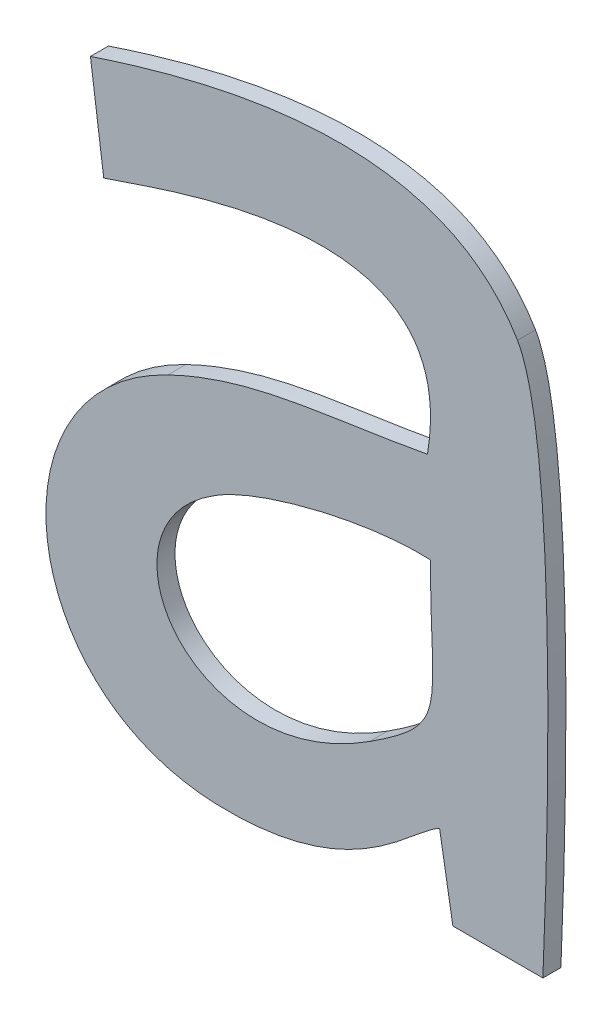
ISO-10303-21;
HEADER;
FILE_DESCRIPTION(('STEP AP214'),'2;1');
FILE_NAME('part.step','',(''),(''),'','','');
FILE_SCHEMA(('AUTOMOTIVE_DESIGN { 1 0 10303 214 1 1 1 1 }'));
ENDSEC;
DATA;
#1=APPLICATION_CONTEXT('core data for automotive mechanical design processes');
#2=APPLICATION_PROTOCOL_DEFINITION('international standard','automotive_design',2000,#1);
#3=PRODUCT_CONTEXT('',#1,'mechanical');
#4=PRODUCT('Part','Part','',(#3));
#5=PRODUCT_RELATED_PRODUCT_CATEGORY('part','',(#4));
#6=PRODUCT_DEFINITION_FORMATION('','',#4);
#7=PRODUCT_DEFINITION_CONTEXT('part definition',#1,'design');
#8=PRODUCT_DEFINITION('design','',#6,#7);
#9=PRODUCT_DEFINITION_SHAPE('','',#8);
#10=(LENGTH_UNIT() NAMED_UNIT(*) SI_UNIT(.MILLI.,.METRE.));
#11=(NAMED_UNIT(*) PLANE_ANGLE_UNIT() SI_UNIT($,.RADIAN.));
#12=(NAMED_UNIT(*) SI_UNIT($,.STERADIAN.) SOLID_ANGLE_UNIT());
#13=UNCERTAINTY_MEASURE_WITH_UNIT(LENGTH_MEASURE(1.E-05),#10,'distance_accuracy_value','');
#14=(GEOMETRIC_REPRESENTATION_CONTEXT(3) GLOBAL_UNCERTAINTY_ASSIGNED_CONTEXT((#13)) GLOBAL_UNIT_ASSIGNED_CONTEXT((#10,
#11,#12)) REPRESENTATION_CONTEXT('',''));
#15=CARTESIAN_POINT('',(0.,0.,0.));
#16=DIRECTION('',(0.,0.,1.));
#17=DIRECTION('',(1.,0.,0.));
#18=AXIS2_PLACEMENT_3D('',#15,#16,#17);
#19=CARTESIAN_POINT('',(-1.7916917578125,-48.6384592578125,0.001));
#20=CARTESIAN_POINT('',(-1.7916917578125,-48.6384592578125,0.));
#21=CARTESIAN_POINT('',(-1.7914358203125,-48.6326046875,0.001));
#22=CARTESIAN_POINT('',(-1.7914358203125,-48.6326046875,0.));
#23=CARTESIAN_POINT('',(-1.7907959765625,-48.6124816015625,0.001));
#24=CARTESIAN_POINT('',(-1.7907959765625,-48.6124816015625,0.));
#25=CARTESIAN_POINT('',(-1.7930994140625,-48.6085465625,0.001));
#26=CARTESIAN_POINT('',(-1.7930994140625,-48.6085465625,0.));
#27=B_SPLINE_SURFACE_WITH_KNOTS('',3,1,((#19,#20),(#21,#22),(#23,#24),(#25,#26)),.UNSPECIFIED.,
.F.,.F.,.F.,(4,4),(2,2),(0.6,0.7),(0.,1.),.UNSPECIFIED.);
#28=CARTESIAN_POINT('',(-1.7916917578125,-48.6384592578125,0.));
#29=CARTESIAN_POINT('',(-1.7914358203125,-48.6326046875,0.));
#30=CARTESIAN_POINT('',(-1.7907959765625,-48.6124816015625,0.));
#31=CARTESIAN_POINT('',(-1.7930994140625,-48.6085465625,0.));
#32=B_SPLINE_CURVE_WITH_KNOTS('',3,(#28,#29,#30,#31),.UNSPECIFIED.,.F.,.F.,(4,4),(0.6,0.7),.UNSPECIFIED.);
#33=CARTESIAN_POINT('',(-1.7916917578125,-48.6384592578125,0.));
#34=VERTEX_POINT('',#33);
#35=CARTESIAN_POINT('',(-1.7930994140625,-48.6085465625,0.));
#36=VERTEX_POINT('',#35);
#37=EDGE_CURVE('E11',#34,#36,#32,.T.);
#38=DIRECTION('',(0.,0.,-1.));
#39=VECTOR('',#38,1.);
#40=CARTESIAN_POINT('',(-1.7930994140625,-48.6085465625,0.001));
#41=LINE('',#40,#39);
#42=CARTESIAN_POINT('',(-1.7930994140625,-48.6085465625,0.001));
#43=VERTEX_POINT('',#42);
#44=EDGE_CURVE('E28',#43,#36,#41,.T.);
#45=CARTESIAN_POINT('',(-1.7916917578125,-48.6384592578125,0.001));
#46=CARTESIAN_POINT('',(-1.7914358203125,-48.6326046875,0.001));
#47=CARTESIAN_POINT('',(-1.7907959765625,-48.6124816015625,0.001));
#48=CARTESIAN_POINT('',(-1.7930994140625,-48.6085465625,0.001));
#49=B_SPLINE_CURVE_WITH_KNOTS('',3,(#45,#46,#47,#48),.UNSPECIFIED.,.F.,.F.,(4,4),(0.6,0.7),.UNSPECIFIED.);
#50=CARTESIAN_POINT('',(-1.7916917578125,-48.6384592578125,0.001));
#51=VERTEX_POINT('',#50);
#52=EDGE_CURVE('E279',#51,#43,#49,.T.);
#53=DIRECTION('',(0.,0.,-1.));
#54=VECTOR('',#53,1.);
#55=CARTESIAN_POINT('',(-1.7916917578125,-48.6384592578125,0.001));
#56=LINE('',#55,#54);
#57=EDGE_CURVE('E40',#51,#34,#56,.T.);
#58=ORIENTED_EDGE('',*,*,#37,.T.);
#59=ORIENTED_EDGE('',*,*,#44,.F.);
#60=ORIENTED_EDGE('',*,*,#52,.F.);
#61=ORIENTED_EDGE('',*,*,#57,.T.);
#62=EDGE_LOOP('',(#58,#59,#60,#61));
#63=FACE_BOUND('',#62,.T.);
#64=ADVANCED_FACE('F17',(#63),#27,.F.);
#65=CARTESIAN_POINT('',(-1.7930994140625,-48.6085465625,0.001));
#66=CARTESIAN_POINT('',(-1.7930994140625,-48.6085465625,0.));
#67=CARTESIAN_POINT('',(-1.7973863671875,-48.6012843359375,0.001));
#68=CARTESIAN_POINT('',(-1.7973863671875,-48.6012843359375,0.));
#69=CARTESIAN_POINT('',(-1.8093514453125,-48.6042916015625,0.001));
#70=CARTESIAN_POINT('',(-1.8093514453125,-48.6042916015625,0.));
#71=CARTESIAN_POINT('',(-1.8167736328125,-48.606755,0.001));
#72=CARTESIAN_POINT('',(-1.8167736328125,-48.606755,0.));
#73=B_SPLINE_SURFACE_WITH_KNOTS('',3,1,((#65,#66),(#67,#68),(#69,#70),(#71,#72)),.UNSPECIFIED.,
.F.,.F.,.F.,(4,4),(2,2),(0.7,0.8),(0.,1.),.UNSPECIFIED.);
#74=CARTESIAN_POINT('',(-1.7930994140625,-48.6085465625,0.));
#75=CARTESIAN_POINT('',(-1.7973863671875,-48.6012843359375,0.));
#76=CARTESIAN_POINT('',(-1.8093514453125,-48.6042916015625,0.));
#77=CARTESIAN_POINT('',(-1.8167736328125,-48.606755,0.));
#78=B_SPLINE_CURVE_WITH_KNOTS('',3,(#74,#75,#76,#77),.UNSPECIFIED.,.F.,.F.,(4,4),(0.7,0.8),.UNSPECIFIED.);
#79=CARTESIAN_POINT('',(-1.8167736328125,-48.606755,0.));
#80=VERTEX_POINT('',#79);
#81=EDGE_CURVE('E271',#36,#80,#78,.T.);
#82=DIRECTION('',(0.,0.,-1.));
#83=VECTOR('',#82,1.);
#84=CARTESIAN_POINT('',(-1.8167736328125,-48.606755,0.001));
#85=LINE('',#84,#83);
#86=CARTESIAN_POINT('',(-1.8167736328125,-48.606755,0.001));
#87=VERTEX_POINT('',#86);
#88=EDGE_CURVE('E266',#87,#80,#85,.T.);
#89=CARTESIAN_POINT('',(-1.7930994140625,-48.6085465625,0.001));
#90=CARTESIAN_POINT('',(-1.7973863671875,-48.6012843359375,0.001));
#91=CARTESIAN_POINT('',(-1.8093514453125,-48.6042916015625,0.001));
#92=CARTESIAN_POINT('',(-1.8167736328125,-48.606755,0.001));
#93=B_SPLINE_CURVE_WITH_KNOTS('',3,(#89,#90,#91,#92),.UNSPECIFIED.,.F.,.F.,(4,4),(0.7,0.8),.UNSPECIFIED.);
#94=EDGE_CURVE('E262',#43,#87,#93,.T.);
#95=ORIENTED_EDGE('',*,*,#81,.T.);
#96=ORIENTED_EDGE('',*,*,#88,.F.);
#97=ORIENTED_EDGE('',*,*,#94,.F.);
#98=ORIENTED_EDGE('',*,*,#44,.T.);
#99=EDGE_LOOP('',(#95,#96,#97,#98));
#100=FACE_BOUND('',#99,.T.);
#101=ADVANCED_FACE('F289',(#100),#73,.F.);
#102=CARTESIAN_POINT('',(-8.2060680286312,-1.1037401442036,0.001));
#103=DIRECTION('',(0.99107539235019,0.133302538152571,0.));
#104=DIRECTION('',(-0.133302538152571,0.99107539235019,0.));
#105=AXIS2_PLACEMENT_3D('',#102,#103,#104);
#106=PLANE('',#105);
#107=DIRECTION('',(0.133302538152571,-0.99107539235019,0.));
#108=VECTOR('',#107,1.);
#109=CARTESIAN_POINT('',(-8.2060680286312,-1.1037401442036,0.));
#110=LINE('',#109,#108);
#111=CARTESIAN_POINT('',(-1.8160378125,-48.6122256640625,0.));
#112=VERTEX_POINT('',#111);
#113=EDGE_CURVE('E260',#80,#112,#110,.T.);
#114=ORIENTED_EDGE('',*,*,#113,.T.);
#115=DIRECTION('',(0.,0.,-1.));
#116=VECTOR('',#115,1.);
#117=CARTESIAN_POINT('',(-1.8160378125,-48.6122256640625,0.001));
#118=LINE('',#117,#116);
#119=CARTESIAN_POINT('',(-1.8160378125,-48.6122256640625,0.001));
#120=VERTEX_POINT('',#119);
#121=EDGE_CURVE('E257',#120,#112,#118,.T.);
#122=ORIENTED_EDGE('',*,*,#121,.F.);
#123=DIRECTION('',(0.133302538152571,-0.99107539235019,0.));
#124=VECTOR('',#123,1.);
#125=CARTESIAN_POINT('',(-8.2060680286312,-1.1037401442036,0.001));
#126=LINE('',#125,#124);
#127=EDGE_CURVE('E251',#87,#120,#126,.T.);
#128=ORIENTED_EDGE('',*,*,#127,.F.);
#129=ORIENTED_EDGE('',*,*,#88,.T.);
#130=EDGE_LOOP('',(#114,#122,#128,#129));
#131=FACE_BOUND('',#130,.T.);
#132=ADVANCED_FACE('F293',(#131),#106,.F.);
#133=CARTESIAN_POINT('',(-1.8160378125,-48.6122256640625,0.001));
#134=CARTESIAN_POINT('',(-1.8160378125,-48.6122256640625,0.));
#135=CARTESIAN_POINT('',(-1.81283859375,-48.61123390625,0.001));
#136=CARTESIAN_POINT('',(-1.81283859375,-48.61123390625,0.));
#137=CARTESIAN_POINT('',(-1.7960746875,-48.6044515625,0.001));
#138=CARTESIAN_POINT('',(-1.7960746875,-48.6044515625,0.));
#139=CARTESIAN_POINT('',(-1.7980901953125,-48.6165126171875,0.001));
#140=CARTESIAN_POINT('',(-1.7980901953125,-48.6165126171875,0.));
#141=B_SPLINE_SURFACE_WITH_KNOTS('',3,1,((#133,#134),(#135,#136),(#137,#138),(#139,#140)),
.UNSPECIFIED.,.F.,.F.,.F.,(4,4),(2,2),(0.,0.1),(0.,1.),.UNSPECIFIED.);
#142=CARTESIAN_POINT('',(-1.8160378125,-48.6122256640625,0.));
#143=CARTESIAN_POINT('',(-1.81283859375,-48.61123390625,0.));
#144=CARTESIAN_POINT('',(-1.7960746875,-48.6044515625,0.));
#145=CARTESIAN_POINT('',(-1.7980901953125,-48.6165126171875,0.));
#146=B_SPLINE_CURVE_WITH_KNOTS('',3,(#142,#143,#144,#145),.UNSPECIFIED.,.F.,.F.,(4,4),(0.,0.1),.UNSPECIFIED.);
#147=CARTESIAN_POINT('',(-1.7980901953125,-48.6165126171875,0.));
#148=VERTEX_POINT('',#147);
#149=EDGE_CURVE('E246',#112,#148,#146,.T.);
#150=DIRECTION('',(0.,0.,-1.));
#151=VECTOR('',#150,1.);
#152=CARTESIAN_POINT('',(-1.7980901953125,-48.6165126171875,0.001));
#153=LINE('',#152,#151);
#154=CARTESIAN_POINT('',(-1.7980901953125,-48.6165126171875,0.001));
#155=VERTEX_POINT('',#154);
#156=EDGE_CURVE('E241',#155,#148,#153,.T.);
#157=CARTESIAN_POINT('',(-1.8160378125,-48.6122256640625,0.001));
#158=CARTESIAN_POINT('',(-1.81283859375,-48.61123390625,0.001));
#159=CARTESIAN_POINT('',(-1.7960746875,-48.6044515625,0.001));
#160=CARTESIAN_POINT('',(-1.7980901953125,-48.6165126171875,0.001));
#161=B_SPLINE_CURVE_WITH_KNOTS('',3,(#157,#158,#159,#160),.UNSPECIFIED.,.F.,.F.,(4,4),(0.,0.1),.UNSPECIFIED.);
#162=EDGE_CURVE('E234',#120,#155,#161,.T.);
#163=ORIENTED_EDGE('',*,*,#149,.T.);
#164=ORIENTED_EDGE('',*,*,#156,.F.);
#165=ORIENTED_EDGE('',*,*,#162,.F.);
#166=ORIENTED_EDGE('',*,*,#121,.T.);
#167=EDGE_LOOP('',(#163,#164,#165,#166));
#168=FACE_BOUND('',#167,.T.);
#169=ADVANCED_FACE('F297',(#168),#141,.F.);
#170=CARTESIAN_POINT('',(-1.7980901953125,-48.6165126171875,0.001));
#171=CARTESIAN_POINT('',(-1.7980901953125,-48.6165126171875,0.));
#172=CARTESIAN_POINT('',(-1.803496875,-48.6175363671875,0.001));
#173=CARTESIAN_POINT('',(-1.803496875,-48.6175363671875,0.));
#174=CARTESIAN_POINT('',(-1.8077518359375,-48.6176003515625,0.001));
#175=CARTESIAN_POINT('',(-1.8077518359375,-48.6176003515625,0.));
#176=CARTESIAN_POINT('',(-1.8124866796875,-48.6199037890625,0.001));
#177=CARTESIAN_POINT('',(-1.8124866796875,-48.6199037890625,0.));
#178=B_SPLINE_SURFACE_WITH_KNOTS('',3,1,((#170,#171),(#172,#173),(#174,#175),(#176,#177)),
.UNSPECIFIED.,.F.,.F.,.F.,(4,4),(2,2),(0.1,0.2),(0.,1.),.UNSPECIFIED.);
#179=CARTESIAN_POINT('',(-1.7980901953125,-48.6165126171875,0.));
#180=CARTESIAN_POINT('',(-1.803496875,-48.6175363671875,0.));
#181=CARTESIAN_POINT('',(-1.8077518359375,-48.6176003515625,0.));
#182=CARTESIAN_POINT('',(-1.8124866796875,-48.6199037890625,0.));
#183=B_SPLINE_CURVE_WITH_KNOTS('',3,(#179,#180,#181,#182),.UNSPECIFIED.,.F.,.F.,(4,4),(0.1,0.2),.UNSPECIFIED.);
#184=CARTESIAN_POINT('',(-1.8124866796875,-48.6199037890625,0.));
#185=VERTEX_POINT('',#184);
#186=EDGE_CURVE('E229',#148,#185,#183,.T.);
#187=DIRECTION('',(0.,0.,-1.));
#188=VECTOR('',#187,1.);
#189=CARTESIAN_POINT('',(-1.8124866796875,-48.6199037890625,0.001));
#190=LINE('',#189,#188);
#191=CARTESIAN_POINT('',(-1.8124866796875,-48.6199037890625,0.001));
#192=VERTEX_POINT('',#191);
#193=EDGE_CURVE('E224',#192,#185,#190,.T.);
#194=CARTESIAN_POINT('',(-1.7980901953125,-48.6165126171875,0.001));
#195=CARTESIAN_POINT('',(-1.803496875,-48.6175363671875,0.001));
#196=CARTESIAN_POINT('',(-1.8077518359375,-48.6176003515625,0.001));
#197=CARTESIAN_POINT('',(-1.8124866796875,-48.6199037890625,0.001));
#198=B_SPLINE_CURVE_WITH_KNOTS('',3,(#194,#195,#196,#197),.UNSPECIFIED.,.F.,.F.,(4,4),(0.1,0.2),.UNSPECIFIED.);
#199=EDGE_CURVE('E217',#155,#192,#198,.T.);
#200=ORIENTED_EDGE('',*,*,#186,.T.);
#201=ORIENTED_EDGE('',*,*,#193,.F.);
#202=ORIENTED_EDGE('',*,*,#199,.F.);
#203=ORIENTED_EDGE('',*,*,#156,.T.);
#204=EDGE_LOOP('',(#200,#201,#202,#203));
#205=FACE_BOUND('',#204,.T.);
#206=ADVANCED_FACE('F303',(#205),#178,.F.);
#207=CARTESIAN_POINT('',(-1.8124866796875,-48.6199037890625,0.001));
#208=CARTESIAN_POINT('',(-1.8124866796875,-48.6199037890625,0.));
#209=CARTESIAN_POINT('',(-1.8226921875,-48.62479859375,0.001));
#210=CARTESIAN_POINT('',(-1.8226921875,-48.62479859375,0.));
#211=CARTESIAN_POINT('',(-1.820964609375,-48.6387471875,0.001));
#212=CARTESIAN_POINT('',(-1.820964609375,-48.6387471875,0.));
#213=CARTESIAN_POINT('',(-1.8097993359375,-48.6391630859375,0.001));
#214=CARTESIAN_POINT('',(-1.8097993359375,-48.6391630859375,0.));
#215=B_SPLINE_SURFACE_WITH_KNOTS('',3,1,((#207,#208),(#209,#210),(#211,#212),(#213,#214)),
.UNSPECIFIED.,.F.,.F.,.F.,(4,4),(2,2),(0.2,0.3),(0.,1.),.UNSPECIFIED.);
#216=CARTESIAN_POINT('',(-1.8124866796875,-48.6199037890625,0.));
#217=CARTESIAN_POINT('',(-1.8226921875,-48.62479859375,0.));
#218=CARTESIAN_POINT('',(-1.820964609375,-48.6387471875,0.));
#219=CARTESIAN_POINT('',(-1.8097993359375,-48.6391630859375,0.));
#220=B_SPLINE_CURVE_WITH_KNOTS('',3,(#216,#217,#218,#219),.UNSPECIFIED.,.F.,.F.,(4,4),(0.2,0.3),.UNSPECIFIED.);
#221=CARTESIAN_POINT('',(-1.8097993359375,-48.6391630859375,0.));
#222=VERTEX_POINT('',#221);
#223=EDGE_CURVE('E212',#185,#222,#220,.T.);
#224=DIRECTION('',(0.,0.,-1.));
#225=VECTOR('',#224,1.);
#226=CARTESIAN_POINT('',(-1.8097993359375,-48.6391630859375,0.001));
#227=LINE('',#226,#225);
#228=CARTESIAN_POINT('',(-1.8097993359375,-48.6391630859375,0.001));
#229=VERTEX_POINT('',#228);
#230=EDGE_CURVE('E207',#229,#222,#227,.T.);
#231=CARTESIAN_POINT('',(-1.8124866796875,-48.6199037890625,0.001));
#232=CARTESIAN_POINT('',(-1.8226921875,-48.62479859375,0.001));
#233=CARTESIAN_POINT('',(-1.820964609375,-48.6387471875,0.001));
#234=CARTESIAN_POINT('',(-1.8097993359375,-48.6391630859375,0.001));
#235=B_SPLINE_CURVE_WITH_KNOTS('',3,(#231,#232,#233,#234),.UNSPECIFIED.,.F.,.F.,(4,4),(0.2,0.3),.UNSPECIFIED.);
#236=EDGE_CURVE('E200',#192,#229,#235,.T.);
#237=ORIENTED_EDGE('',*,*,#223,.T.);
#238=ORIENTED_EDGE('',*,*,#230,.F.);
#239=ORIENTED_EDGE('',*,*,#236,.F.);
#240=ORIENTED_EDGE('',*,*,#193,.T.);
#241=EDGE_LOOP('',(#237,#238,#239,#240));
#242=FACE_BOUND('',#241,.T.);
#243=ADVANCED_FACE('F309',(#242),#215,.F.);
#244=CARTESIAN_POINT('',(-1.8097993359375,-48.6391630859375,0.001));
#245=CARTESIAN_POINT('',(-1.8097993359375,-48.6391630859375,0.));
#246=CARTESIAN_POINT('',(-1.802153203125,-48.6394190234375,0.001));
#247=CARTESIAN_POINT('',(-1.802153203125,-48.6394190234375,0.));
#248=CARTESIAN_POINT('',(-1.7991139453125,-48.6350041015625,0.001));
#249=CARTESIAN_POINT('',(-1.7991139453125,-48.6350041015625,0.));
#250=CARTESIAN_POINT('',(-1.797418359375,-48.6341403125,0.001));
#251=CARTESIAN_POINT('',(-1.797418359375,-48.6341403125,0.));
#252=B_SPLINE_SURFACE_WITH_KNOTS('',3,1,((#244,#245),(#246,#247),(#248,#249),(#250,#251)),
.UNSPECIFIED.,.F.,.F.,.F.,(4,4),(2,2),(0.3,0.4),(0.,1.),.UNSPECIFIED.);
#253=CARTESIAN_POINT('',(-1.8097993359375,-48.6391630859375,0.));
#254=CARTESIAN_POINT('',(-1.802153203125,-48.6394190234375,0.));
#255=CARTESIAN_POINT('',(-1.7991139453125,-48.6350041015625,0.));
#256=CARTESIAN_POINT('',(-1.797418359375,-48.6341403125,0.));
#257=B_SPLINE_CURVE_WITH_KNOTS('',3,(#253,#254,#255,#256),.UNSPECIFIED.,.F.,.F.,(4,4),(0.3,0.4),.UNSPECIFIED.);
#258=CARTESIAN_POINT('',(-1.797418359375,-48.6341403125,0.));
#259=VERTEX_POINT('',#258);
#260=EDGE_CURVE('E195',#222,#259,#257,.T.);
#261=DIRECTION('',(0.,0.,-1.));
#262=VECTOR('',#261,1.);
#263=CARTESIAN_POINT('',(-1.797418359375,-48.6341403125,0.001));
#264=LINE('',#263,#262);
#265=CARTESIAN_POINT('',(-1.797418359375,-48.6341403125,0.001));
#266=VERTEX_POINT('',#265);
#267=EDGE_CURVE('E190',#266,#259,#264,.T.);
#268=CARTESIAN_POINT('',(-1.8097993359375,-48.6391630859375,0.001));
#269=CARTESIAN_POINT('',(-1.802153203125,-48.6394190234375,0.001));
#270=CARTESIAN_POINT('',(-1.7991139453125,-48.6350041015625,0.001));
#271=CARTESIAN_POINT('',(-1.797418359375,-48.6341403125,0.001));
#272=B_SPLINE_CURVE_WITH_KNOTS('',3,(#268,#269,#270,#271),.UNSPECIFIED.,.F.,.F.,(4,4),(0.3,0.4),.UNSPECIFIED.);
#273=EDGE_CURVE('E186',#229,#266,#272,.T.);
#274=ORIENTED_EDGE('',*,*,#260,.T.);
#275=ORIENTED_EDGE('',*,*,#267,.F.);
#276=ORIENTED_EDGE('',*,*,#273,.F.);
#277=ORIENTED_EDGE('',*,*,#230,.T.);
#278=EDGE_LOOP('',(#274,#275,#276,#277));
#279=FACE_BOUND('',#278,.T.);
#280=ADVANCED_FACE('F313',(#279),#252,.F.);
#281=CARTESIAN_POINT('',(-9.7988138674383,-1.669427547786,0.001));
#282=DIRECTION('',(0.985795457601301,0.167950337220981,0.));
#283=DIRECTION('',(-0.167950337220981,0.985795457601301,0.));
#284=AXIS2_PLACEMENT_3D('',#281,#282,#283);
#285=PLANE('',#284);
#286=DIRECTION('',(0.167950337220981,-0.985795457601301,0.));
#287=VECTOR('',#286,1.);
#288=CARTESIAN_POINT('',(-9.7988138674383,-1.669427547786,0.));
#289=LINE('',#288,#287);
#290=CARTESIAN_POINT('',(-1.7966825390625,-48.6384592578125,0.));
#291=VERTEX_POINT('',#290);
#292=EDGE_CURVE('E184',#259,#291,#289,.T.);
#293=ORIENTED_EDGE('',*,*,#292,.T.);
#294=DIRECTION('',(0.,0.,-1.));
#295=VECTOR('',#294,1.);
#296=CARTESIAN_POINT('',(-1.7966825390625,-48.6384592578125,0.001));
#297=LINE('',#296,#295);
#298=CARTESIAN_POINT('',(-1.7966825390625,-48.6384592578125,0.001));
#299=VERTEX_POINT('',#298);
#300=EDGE_CURVE('E181',#299,#291,#297,.T.);
#301=ORIENTED_EDGE('',*,*,#300,.F.);
#302=DIRECTION('',(0.167950337220981,-0.985795457601301,0.));
#303=VECTOR('',#302,1.);
#304=CARTESIAN_POINT('',(-9.7988138674383,-1.669427547786,0.001));
#305=LINE('',#304,#303);
#306=EDGE_CURVE('E175',#266,#299,#305,.T.);
#307=ORIENTED_EDGE('',*,*,#306,.F.);
#308=ORIENTED_EDGE('',*,*,#267,.T.);
#309=EDGE_LOOP('',(#293,#301,#307,#308));
#310=FACE_BOUND('',#309,.T.);
#311=ADVANCED_FACE('F317',(#310),#285,.F.);
#312=CARTESIAN_POINT('',(-1.8012894140625,-48.631900859375,0.001));
#313=CARTESIAN_POINT('',(-1.8012894140625,-48.631900859375,0.));
#314=CARTESIAN_POINT('',(-1.811366953125,-48.638427265625,0.001));
#315=CARTESIAN_POINT('',(-1.811366953125,-48.638427265625,0.));
#316=CARTESIAN_POINT('',(-1.81770140625,-48.6281577734375,0.001));
#317=CARTESIAN_POINT('',(-1.81770140625,-48.6281577734375,0.));
#318=CARTESIAN_POINT('',(-1.808935546875,-48.6238708203125,0.001));
#319=CARTESIAN_POINT('',(-1.808935546875,-48.6238708203125,0.));
#320=B_SPLINE_SURFACE_WITH_KNOTS('',3,1,((#312,#313),(#314,#315),(#316,#317),(#318,#319)),
.UNSPECIFIED.,.F.,.F.,.F.,(4,4),(2,2),(0.25,0.5),(0.,1.),.UNSPECIFIED.);
#321=CARTESIAN_POINT('',(-1.8012894140625,-48.631900859375,0.));
#322=CARTESIAN_POINT('',(-1.811366953125,-48.638427265625,0.));
#323=CARTESIAN_POINT('',(-1.81770140625,-48.6281577734375,0.));
#324=CARTESIAN_POINT('',(-1.808935546875,-48.6238708203125,0.));
#325=B_SPLINE_CURVE_WITH_KNOTS('',3,(#321,#322,#323,#324),.UNSPECIFIED.,.F.,.F.,(4,4),(0.25,
0.5),.UNSPECIFIED.);
#326=CARTESIAN_POINT('',(-1.8012894140625,-48.631900859375,0.));
#327=VERTEX_POINT('',#326);
#328=CARTESIAN_POINT('',(-1.808935546875,-48.6238708203125,0.));
#329=VERTEX_POINT('',#328);
#330=EDGE_CURVE('E170',#327,#329,#325,.T.);
#331=DIRECTION('',(0.,0.,-1.));
#332=VECTOR('',#331,1.);
#333=CARTESIAN_POINT('',(-1.808935546875,-48.6238708203125,0.001));
#334=LINE('',#333,#332);
#335=CARTESIAN_POINT('',(-1.808935546875,-48.6238708203125,0.001));
#336=VERTEX_POINT('',#335);
#337=EDGE_CURVE('E165',#336,#329,#334,.T.);
#338=CARTESIAN_POINT('',(-1.8012894140625,-48.631900859375,0.001));
#339=CARTESIAN_POINT('',(-1.811366953125,-48.638427265625,0.001));
#340=CARTESIAN_POINT('',(-1.81770140625,-48.6281577734375,0.001));
#341=CARTESIAN_POINT('',(-1.808935546875,-48.6238708203125,0.001));
#342=B_SPLINE_CURVE_WITH_KNOTS('',3,(#338,#339,#340,#341),.UNSPECIFIED.,.F.,.F.,(4,4),(0.25,
0.5),.UNSPECIFIED.);
#343=CARTESIAN_POINT('',(-1.8012894140625,-48.631900859375,0.001));
#344=VERTEX_POINT('',#343);
#345=EDGE_CURVE('E116',#344,#336,#342,.T.);
#346=DIRECTION('',(0.,0.,-1.));
#347=VECTOR('',#346,1.);
#348=CARTESIAN_POINT('',(-1.8012894140625,-48.631900859375,0.001));
#349=LINE('',#348,#347);
#350=EDGE_CURVE('E131',#344,#327,#349,.T.);
#351=ORIENTED_EDGE('',*,*,#330,.T.);
#352=ORIENTED_EDGE('',*,*,#337,.F.);
#353=ORIENTED_EDGE('',*,*,#345,.F.);
#354=ORIENTED_EDGE('',*,*,#350,.T.);
#355=EDGE_LOOP('',(#351,#352,#353,#354));
#356=FACE_BOUND('',#355,.T.);
#357=ADVANCED_FACE('F386',(#356),#320,.F.);
#358=CARTESIAN_POINT('',(-1.808935546875,-48.6238708203125,0.001));
#359=CARTESIAN_POINT('',(-1.808935546875,-48.6238708203125,0.));
#360=CARTESIAN_POINT('',(-1.8063121875,-48.6225911328125,0.001));
#361=CARTESIAN_POINT('',(-1.8063121875,-48.6225911328125,0.));
#362=CARTESIAN_POINT('',(-1.8011934375,-48.6213434375,0.001));
#363=CARTESIAN_POINT('',(-1.8011934375,-48.6213434375,0.));
#364=CARTESIAN_POINT('',(-1.797930234375,-48.6215033984375,0.001));
#365=CARTESIAN_POINT('',(-1.797930234375,-48.6215033984375,0.));
#366=B_SPLINE_SURFACE_WITH_KNOTS('',3,1,((#358,#359),(#360,#361),(#362,#363),(#364,#365)),
.UNSPECIFIED.,.F.,.F.,.F.,(4,4),(2,2),(0.5,1.),(0.,1.),.UNSPECIFIED.);
#367=CARTESIAN_POINT('',(-1.808935546875,-48.6238708203125,0.));
#368=CARTESIAN_POINT('',(-1.8063121875,-48.6225911328125,0.));
#369=CARTESIAN_POINT('',(-1.8011934375,-48.6213434375,0.));
#370=CARTESIAN_POINT('',(-1.797930234375,-48.6215033984375,0.));
#371=B_SPLINE_CURVE_WITH_KNOTS('',3,(#367,#368,#369,#370),.UNSPECIFIED.,.F.,.F.,(4,4),(0.5,1.),.UNSPECIFIED.);
#372=CARTESIAN_POINT('',(-1.797930234375,-48.6215033984375,0.));
#373=VERTEX_POINT('',#372);
#374=EDGE_CURVE('E125',#329,#373,#371,.T.);
#375=DIRECTION('',(0.,0.,-1.));
#376=VECTOR('',#375,1.);
#377=CARTESIAN_POINT('',(-1.797930234375,-48.6215033984375,0.001));
#378=LINE('',#377,#376);
#379=CARTESIAN_POINT('',(-1.797930234375,-48.6215033984375,0.001));
#380=VERTEX_POINT('',#379);
#381=EDGE_CURVE('E119',#380,#373,#378,.T.);
#382=CARTESIAN_POINT('',(-1.808935546875,-48.6238708203125,0.001));
#383=CARTESIAN_POINT('',(-1.8063121875,-48.6225911328125,0.001));
#384=CARTESIAN_POINT('',(-1.8011934375,-48.6213434375,0.001));
#385=CARTESIAN_POINT('',(-1.797930234375,-48.6215033984375,0.001));
#386=B_SPLINE_CURVE_WITH_KNOTS('',3,(#382,#383,#384,#385),.UNSPECIFIED.,.F.,.F.,(4,4),(0.5,1.),.UNSPECIFIED.);
#387=EDGE_CURVE('E109',#336,#380,#386,.T.);
#388=ORIENTED_EDGE('',*,*,#374,.T.);
#389=ORIENTED_EDGE('',*,*,#381,.F.);
#390=ORIENTED_EDGE('',*,*,#387,.F.);
#391=ORIENTED_EDGE('',*,*,#337,.T.);
#392=EDGE_LOOP('',(#388,#389,#390,#391));
#393=FACE_BOUND('',#392,.T.);
#394=ADVANCED_FACE('F123',(#393),#366,.F.);
#395=CARTESIAN_POINT('',(-1.797930234375,-48.6215033984375,0.001));
#396=CARTESIAN_POINT('',(-1.797930234375,-48.6215033984375,0.));
#397=CARTESIAN_POINT('',(-1.797930234375,-48.628765625,0.001));
#398=CARTESIAN_POINT('',(-1.797930234375,-48.628765625,0.));
#399=CARTESIAN_POINT('',(-1.796778515625,-48.6289895703125,0.001));
#400=CARTESIAN_POINT('',(-1.796778515625,-48.6289895703125,0.));
#401=CARTESIAN_POINT('',(-1.8012894140625,-48.631900859375,0.001));
#402=CARTESIAN_POINT('',(-1.8012894140625,-48.631900859375,0.));
#403=B_SPLINE_SURFACE_WITH_KNOTS('',3,1,((#395,#396),(#397,#398),(#399,#400),(#401,#402)),
.UNSPECIFIED.,.F.,.F.,.F.,(4,4),(2,2),(0.,0.25),(0.,1.),.UNSPECIFIED.);
#404=CARTESIAN_POINT('',(-1.797930234375,-48.6215033984375,0.));
#405=CARTESIAN_POINT('',(-1.797930234375,-48.628765625,0.));
#406=CARTESIAN_POINT('',(-1.796778515625,-48.6289895703125,0.));
#407=CARTESIAN_POINT('',(-1.8012894140625,-48.631900859375,0.));
#408=B_SPLINE_CURVE_WITH_KNOTS('',3,(#404,#405,#406,#407),.UNSPECIFIED.,.F.,.F.,(4,4),(0.,0.25),.UNSPECIFIED.);
#409=EDGE_CURVE('E120',#373,#327,#408,.T.);
#410=CARTESIAN_POINT('',(-1.797930234375,-48.6215033984375,0.001));
#411=CARTESIAN_POINT('',(-1.797930234375,-48.628765625,0.001));
#412=CARTESIAN_POINT('',(-1.796778515625,-48.6289895703125,0.001));
#413=CARTESIAN_POINT('',(-1.8012894140625,-48.631900859375,0.001));
#414=B_SPLINE_CURVE_WITH_KNOTS('',3,(#410,#411,#412,#413),.UNSPECIFIED.,.F.,.F.,(4,4),(0.,0.25),.UNSPECIFIED.);
#415=EDGE_CURVE('E114',#380,#344,#414,.T.);
#416=ORIENTED_EDGE('',*,*,#409,.T.);
#417=ORIENTED_EDGE('',*,*,#350,.F.);
#418=ORIENTED_EDGE('',*,*,#415,.F.);
#419=ORIENTED_EDGE('',*,*,#381,.T.);
#420=EDGE_LOOP('',(#416,#417,#418,#419));
#421=FACE_BOUND('',#420,.T.);
#422=ADVANCED_FACE('F130',(#421),#403,.F.);
#423=CARTESIAN_POINT('',(0.,-48.6384592578125,0.001));
#424=DIRECTION('',(0.,1.,0.));
#425=DIRECTION('',(0.,0.,1.));
#426=AXIS2_PLACEMENT_3D('',#423,#424,#425);
#427=PLANE('',#426);
#428=DIRECTION('',(1.,0.,0.));
#429=VECTOR('',#428,1.);
#430=CARTESIAN_POINT('',(0.,-48.6384592578125,0.));
#431=LINE('',#430,#429);
#432=EDGE_CURVE('E132',#291,#34,#431,.T.);
#433=ORIENTED_EDGE('',*,*,#432,.T.);
#434=ORIENTED_EDGE('',*,*,#57,.F.);
#435=DIRECTION('',(1.,0.,0.));
#436=VECTOR('',#435,1.);
#437=CARTESIAN_POINT('',(0.,-48.6384592578125,0.001));
#438=LINE('',#437,#436);
#439=EDGE_CURVE('E136',#299,#51,#438,.T.);
#440=ORIENTED_EDGE('',*,*,#439,.F.);
#441=ORIENTED_EDGE('',*,*,#300,.T.);
#442=EDGE_LOOP('',(#433,#434,#440,#441));
#443=FACE_BOUND('',#442,.T.);
#444=ADVANCED_FACE('F319',(#443),#427,.F.);
#445=CARTESIAN_POINT('',(0.,0.,0.001));
#446=DIRECTION('',(0.,0.,1.));
#447=DIRECTION('',(1.,0.,0.));
#448=AXIS2_PLACEMENT_3D('',#445,#446,#447);
#449=PLANE('',#448);
#450=ORIENTED_EDGE('',*,*,#345,.T.);
#451=ORIENTED_EDGE('',*,*,#387,.T.);
#452=ORIENTED_EDGE('',*,*,#415,.T.);
#453=EDGE_LOOP('',(#450,#451,#452));
#454=FACE_BOUND('',#453,.T.);
#455=ORIENTED_EDGE('',*,*,#52,.T.);
#456=ORIENTED_EDGE('',*,*,#94,.T.);
#457=ORIENTED_EDGE('',*,*,#127,.T.);
#458=ORIENTED_EDGE('',*,*,#162,.T.);
#459=ORIENTED_EDGE('',*,*,#199,.T.);
#460=ORIENTED_EDGE('',*,*,#236,.T.);
#461=ORIENTED_EDGE('',*,*,#273,.T.);
#462=ORIENTED_EDGE('',*,*,#306,.T.);
#463=ORIENTED_EDGE('',*,*,#439,.T.);
#464=EDGE_LOOP('',(#455,#456,#457,#458,#459,#460,#461,#462,#463));
#465=FACE_BOUND('',#464,.T.);
#466=ADVANCED_FACE('F111',(#454,#465),#449,.T.);
#467=CARTESIAN_POINT('',(0.,0.,0.));
#468=DIRECTION('',(0.,0.,1.));
#469=DIRECTION('',(1.,0.,0.));
#470=AXIS2_PLACEMENT_3D('',#467,#468,#469);
#471=PLANE('',#470);
#472=ORIENTED_EDGE('',*,*,#330,.F.);
#473=ORIENTED_EDGE('',*,*,#409,.F.);
#474=ORIENTED_EDGE('',*,*,#374,.F.);
#475=EDGE_LOOP('',(#472,#473,#474));
#476=FACE_BOUND('',#475,.T.);
#477=ORIENTED_EDGE('',*,*,#37,.F.);
#478=ORIENTED_EDGE('',*,*,#432,.F.);
#479=ORIENTED_EDGE('',*,*,#292,.F.);
#480=ORIENTED_EDGE('',*,*,#260,.F.);
#481=ORIENTED_EDGE('',*,*,#223,.F.);
#482=ORIENTED_EDGE('',*,*,#186,.F.);
#483=ORIENTED_EDGE('',*,*,#149,.F.);
#484=ORIENTED_EDGE('',*,*,#113,.F.);
#485=ORIENTED_EDGE('',*,*,#81,.F.);
#486=EDGE_LOOP('',(#477,#478,#479,#480,#481,#482,#483,#484,#485));
#487=FACE_BOUND('',#486,.T.);
#488=ADVANCED_FACE('F322',(#476,#487),#471,.F.);
#489=CLOSED_SHELL('',(#64,#101,#132,#169,#206,#243,#280,#311,#357,#394,#422,#444,#466,#488));
#490=MANIFOLD_SOLID_BREP('B1',#489);
#491=ADVANCED_BREP_SHAPE_REPRESENTATION('',(#18,#490),#14);
#492=SHAPE_DEFINITION_REPRESENTATION(#9,#491);
ENDSEC;
END-ISO-10303-21;
